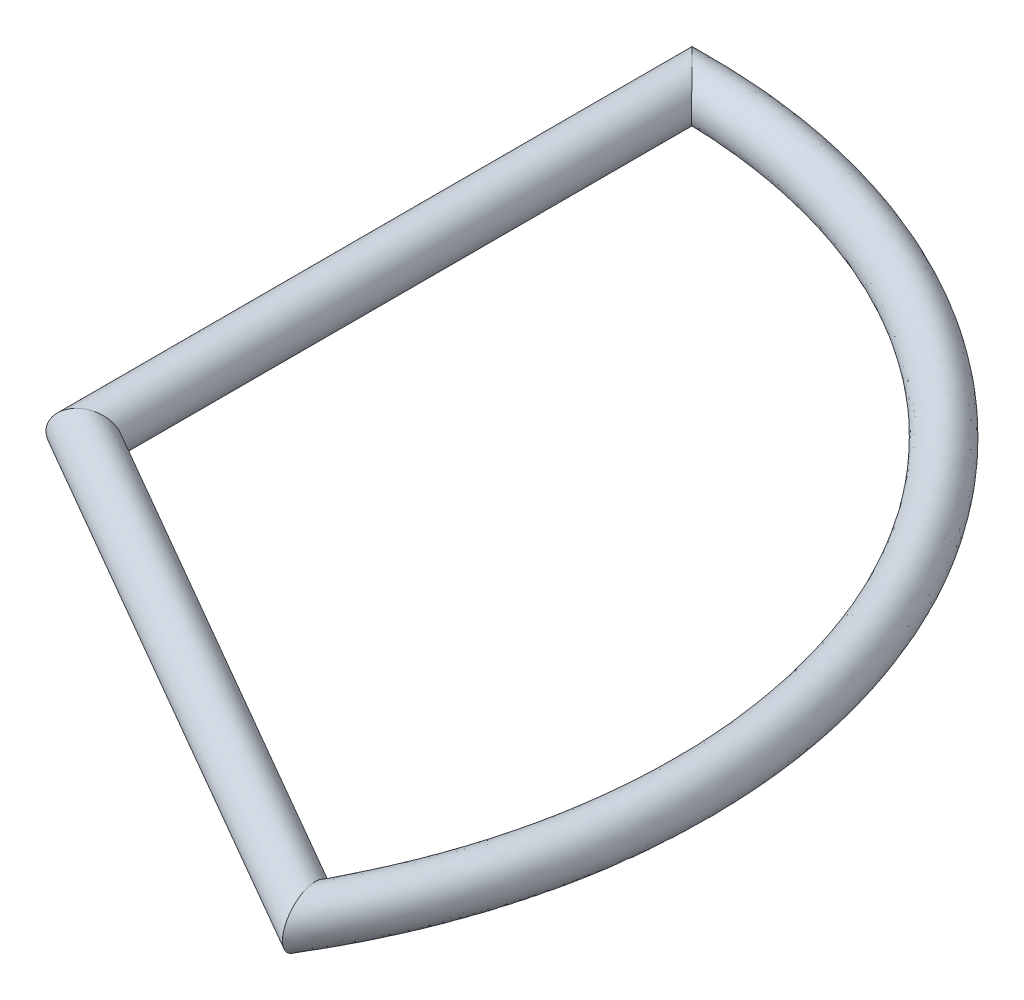
ISO-10303-21;
HEADER;
FILE_DESCRIPTION(('STEP AP214'),'2;1');
FILE_NAME('part.step','',(''),(''),'','','');
FILE_SCHEMA(('AUTOMOTIVE_DESIGN { 1 0 10303 214 1 1 1 1 }'));
ENDSEC;
DATA;
#1=APPLICATION_CONTEXT('core data for automotive mechanical design processes');
#2=APPLICATION_PROTOCOL_DEFINITION('international standard','automotive_design',2000,#1);
#3=PRODUCT_CONTEXT('',#1,'mechanical');
#4=PRODUCT('Part','Part','',(#3));
#5=PRODUCT_RELATED_PRODUCT_CATEGORY('part','',(#4));
#6=PRODUCT_DEFINITION_FORMATION('','',#4);
#7=PRODUCT_DEFINITION_CONTEXT('part definition',#1,'design');
#8=PRODUCT_DEFINITION('design','',#6,#7);
#9=PRODUCT_DEFINITION_SHAPE('','',#8);
#10=(LENGTH_UNIT() NAMED_UNIT(*) SI_UNIT(.MILLI.,.METRE.));
#11=(NAMED_UNIT(*) PLANE_ANGLE_UNIT() SI_UNIT($,.RADIAN.));
#12=(NAMED_UNIT(*) SI_UNIT($,.STERADIAN.) SOLID_ANGLE_UNIT());
#13=UNCERTAINTY_MEASURE_WITH_UNIT(LENGTH_MEASURE(1.E-05),#10,'distance_accuracy_value','');
#14=(GEOMETRIC_REPRESENTATION_CONTEXT(3) GLOBAL_UNCERTAINTY_ASSIGNED_CONTEXT((#13)) GLOBAL_UNIT_ASSIGNED_CONTEXT((#10,
#11,#12)) REPRESENTATION_CONTEXT('',''));
#15=CARTESIAN_POINT('',(0.,0.,0.));
#16=DIRECTION('',(0.,0.,1.));
#17=DIRECTION('',(1.,0.,0.));
#18=AXIS2_PLACEMENT_3D('',#15,#16,#17);
#19=CARTESIAN_POINT('',(28.7927465996211,0.,16.6235000000001));
#20=DIRECTION('',(-0.866025403784436,0.,-0.500000000000004));
#21=DIRECTION('',(-0.500000000000004,0.,0.866025403784436));
#22=AXIS2_PLACEMENT_3D('',#19,#20,#21);
#23=CYLINDRICAL_SURFACE('',#22,1.27);
#24=CARTESIAN_POINT('',(27.4963065701557,1.27,15.875));
#25=CARTESIAN_POINT('',(27.4969214642074,1.26999998985122,15.8772947797057));
#26=CARTESIAN_POINT('',(27.4975363774385,1.26999665709549,15.8795896312304));
#27=CARTESIAN_POINT('',(27.5338248542325,1.26960380813354,16.0150179661764));
#28=CARTESIAN_POINT('',(27.5695534037974,1.25802988155791,16.1483574657615));
#29=CARTESIAN_POINT('',(27.6400852563263,1.21179781113142,16.4115845333933));
#30=CARTESIAN_POINT('',(27.6748865141054,1.1770924302441,16.5414644710377));
#31=CARTESIAN_POINT('',(27.7319882583549,1.09703720224082,16.7545713890624));
#32=CARTESIAN_POINT('',(27.7548886480355,1.05807213294263,16.8400370819576));
#33=CARTESIAN_POINT('',(27.7988700856306,0.967092671233383,17.0041787155149));
#34=CARTESIAN_POINT('',(27.8199551342778,0.915108015454744,17.0828695868332));
#35=CARTESIAN_POINT('',(27.8542594044767,0.812424274799389,17.2108955412529));
#36=CARTESIAN_POINT('',(27.8681043769644,0.764854897462241,17.2625659635498));
#37=CARTESIAN_POINT('',(27.8936947033329,0.66185523842023,17.3580708716471));
#38=CARTESIAN_POINT('',(27.9054423322164,0.606433592655216,17.401913847931));
#39=CARTESIAN_POINT('',(27.9240271140674,0.500120588690125,17.4712735422021));
#40=CARTESIAN_POINT('',(27.9313767966611,0.450571661631831,17.4987030602328));
#41=CARTESIAN_POINT('',(27.9438597728602,0.347484370881552,17.5452903717993));
#42=CARTESIAN_POINT('',(27.9489969335109,0.29395316111034,17.5644625974285));
#43=CARTESIAN_POINT('',(27.9555786248677,0.200168825391895,17.5890259047741));
#44=CARTESIAN_POINT('',(27.9576623214946,0.160575505241367,17.5968023971602));
#45=CARTESIAN_POINT('',(27.9604531863403,0.0806613114978532,17.6072180873077));
#46=CARTESIAN_POINT('',(27.9611601722016,0.0403403422352147,17.6098566044994));
#47=CARTESIAN_POINT('',(27.9611574532638,-0.0566239082998585,17.6098464573199));
#48=CARTESIAN_POINT('',(27.9597607005151,-0.113285986127845,17.6046336853695));
#49=CARTESIAN_POINT('',(27.9542916379542,-0.224662733321905,17.5842227847676));
#50=CARTESIAN_POINT('',(27.9502161264058,-0.279374989599951,17.5690127070236));
#51=CARTESIAN_POINT('',(27.9397449180558,-0.384902732857072,17.5299334563946));
#52=CARTESIAN_POINT('',(27.9333650543853,-0.435742011837644,17.5061233738715));
#53=CARTESIAN_POINT('',(27.9186757084718,-0.533023337754585,17.4513017272005));
#54=CARTESIAN_POINT('',(27.9103655069249,-0.579463736427295,17.4202874785559));
#55=CARTESIAN_POINT('',(27.8884811701319,-0.685558108569258,17.338613599404));
#56=CARTESIAN_POINT('',(27.8741436358349,-0.742857364426685,17.2851049040859));
#57=CARTESIAN_POINT('',(27.8432635179,-0.84790601153226,17.1698581159828));
#58=CARTESIAN_POINT('',(27.8267146712379,-0.895627277700198,17.1080966491562));
#59=CARTESIAN_POINT('',(27.7969612979477,-0.969698228065375,16.9970550081041));
#60=CARTESIAN_POINT('',(27.784122286089,-0.998286527447249,16.9491389458228));
#61=CARTESIAN_POINT('',(27.7578574707548,-1.05084209395177,16.8511169348892));
#62=CARTESIAN_POINT('',(27.7444326813281,-1.07481698624917,16.8010147706359));
#63=CARTESIAN_POINT('',(27.7034166121963,-1.14027743682543,16.6479403392599));
#64=CARTESIAN_POINT('',(27.6751122707574,-1.17523007740622,16.5423070168282));
#65=CARTESIAN_POINT('',(27.6220793673155,-1.2246352781542,16.3443859624406));
#66=CARTESIAN_POINT('',(27.5974896378778,-1.24144936731578,16.2526162682291));
#67=CARTESIAN_POINT('',(27.5479767021379,-1.26398728683644,16.0678329542183));
#68=CARTESIAN_POINT('',(27.5230537833404,-1.26972012645811,15.9748204068908));
#69=CARTESIAN_POINT('',(27.4975363812735,-1.26999666412354,15.8795896455433));
#70=CARTESIAN_POINT('',(27.4969214679992,-1.26999999709977,15.8772947938574));
#71=CARTESIAN_POINT('',(27.4963065701557,-1.27,15.875));
#72=B_SPLINE_CURVE_WITH_KNOTS('',3,(#24,#25,#26,#27,#28,#29,#30,#31,#32,#33,#34,#35,#36,#37,#38,
#39,#40,#41,#42,#43,#44,#45,#46,#47,#48,#49,#50,#51,#52,#53,#54,#55,#56,#57,#58,#59,#60,#61,#62,
#63,#64,#65,#66,#67,#68,#69,#70,#71),.UNSPECIFIED.,.F.,.F.,(4,2,2,2,2,2,2,2,2,2,2,2,2,2,2,2,2,2,
2,2,2,2,2,4),(0.,0.00712741888772688,0.420606172941244,0.83493189488802,1.12406729546069,
1.41254824123145,1.62658892472379,1.84039600726779,2.01106048621675,2.1814254552545,
2.3023034445527,2.42319744410438,2.59289086675069,2.76278748200641,2.93153828292778,
3.10035206681709,3.33814572734207,3.5766277522816,3.74815421597806,3.91939469360271,
4.26226139955855,4.55113345364006,4.8397705504049,4.84689796929262),.UNSPECIFIED.);
#73=CARTESIAN_POINT('',(27.4963065701557,1.27,15.875));
#74=VERTEX_POINT('',#73);
#75=CARTESIAN_POINT('',(27.4963065701557,-1.27,15.875));
#76=VERTEX_POINT('',#75);
#77=EDGE_CURVE('E36',#74,#76,#72,.T.);
#78=ORIENTED_EDGE('',*,*,#77,.F.);
#79=CARTESIAN_POINT('',(27.4963065701557,1.27,15.875));
#80=CARTESIAN_POINT('',(27.4956916765024,1.26999998976507,15.8727052187226));
#81=CARTESIAN_POINT('',(27.4950766722444,1.2699966570136,15.8704103916472));
#82=CARTESIAN_POINT('',(27.4584095971796,1.26959987950454,15.7336127100233));
#83=CARTESIAN_POINT('',(27.4219875447683,1.25779318879046,15.5989882910845));
#84=CARTESIAN_POINT('',(27.3494790714927,1.21092843828973,15.33339198421));
#85=CARTESIAN_POINT('',(27.3133935657792,1.17581926024485,15.2024287875218));
#86=CARTESIAN_POINT('',(27.2535081473661,1.09484568610324,14.9869305889633));
#87=CARTESIAN_POINT('',(27.2292426076091,1.05527297641468,14.9001589835931));
#88=CARTESIAN_POINT('',(27.1823832259628,0.962886612098985,14.7335346740317));
#89=CARTESIAN_POINT('',(27.1597856231871,0.910104002741091,14.6536663300503));
#90=CARTESIAN_POINT('',(27.1231511909035,0.806615694540184,14.524826036936));
#91=CARTESIAN_POINT('',(27.1084583088276,0.759254543035397,14.4733613221204));
#92=CARTESIAN_POINT('',(27.0811878554279,0.656735549503093,14.3781403917081));
#93=CARTESIAN_POINT('',(27.0686078783303,0.601586708192637,14.334375406391));
#94=CARTESIAN_POINT('',(27.0487318956416,0.496231268267525,14.2653953431346));
#95=CARTESIAN_POINT('',(27.0408810333259,0.447421975099813,14.2382147929855));
#96=CARTESIAN_POINT('',(27.0274956213471,0.345830534338047,14.1919369038606));
#97=CARTESIAN_POINT('',(27.0219569839865,0.293055594112111,14.1728252994078));
#98=CARTESIAN_POINT('',(27.0147911117378,0.2000725609079,14.1481166340965));
#99=CARTESIAN_POINT('',(27.0125013759883,0.160516181367087,14.1402285117067));
#100=CARTESIAN_POINT('',(27.009433020129,0.0806463915532493,14.1296602327367));
#101=CARTESIAN_POINT('',(27.0086545693617,0.040332896954889,14.1269806597851));
#102=CARTESIAN_POINT('',(27.0086577363679,-0.0560352036821328,14.1269911914515));
#103=CARTESIAN_POINT('',(27.0101647046629,-0.112107857858795,14.1321779441015));
#104=CARTESIAN_POINT('',(27.0160515945037,-0.222287947171014,14.1524614808419));
#105=CARTESIAN_POINT('',(27.0204350721535,-0.276392862181267,14.1675705314568));
#106=CARTESIAN_POINT('',(27.0316564190515,-0.380678532419805,14.206315372831));
#107=CARTESIAN_POINT('',(27.0384762092818,-0.430884961561547,14.2298883620459));
#108=CARTESIAN_POINT('',(27.0541193648653,-0.526949848361964,14.2840787043163));
#109=CARTESIAN_POINT('',(27.0629435476083,-0.572806521347839,14.3146989312982));
#110=CARTESIAN_POINT('',(27.0863393082963,-0.678734305692221,14.3960945491155));
#111=CARTESIAN_POINT('',(27.1017425417994,-0.736328730869981,14.4498476738357));
#112=CARTESIAN_POINT('',(27.1347461529962,-0.841880517539399,14.5655303857289));
#113=CARTESIAN_POINT('',(27.1523509160205,-0.889818131148607,14.6274763071201));
#114=CARTESIAN_POINT('',(27.1835440310155,-0.963586678798072,14.7377572041976));
#115=CARTESIAN_POINT('',(27.196770960399,-0.991753383895898,14.7846654102202));
#116=CARTESIAN_POINT('',(27.2237265119856,-1.04369814137381,14.8805863773523));
#117=CARTESIAN_POINT('',(27.2374542218328,-1.06748373975265,14.9295953371485));
#118=CARTESIAN_POINT('',(27.2792453174113,-1.13270573756961,15.0793182902504));
#119=CARTESIAN_POINT('',(27.3078873564526,-1.16794052755428,15.1826248801874));
#120=CARTESIAN_POINT('',(27.3628997737089,-1.22016899619412,15.3825042251818));
#121=CARTESIAN_POINT('',(27.3892137633154,-1.23862506875641,15.4787288523652));
#122=CARTESIAN_POINT('',(27.4419020024439,-1.26338859000676,15.672688904192));
#123=CARTESIAN_POINT('',(27.468276181569,-1.26970637063076,15.7704229725179));
#124=CARTESIAN_POINT('',(27.4950766687279,-1.26999666345783,15.8704103793044));
#125=CARTESIAN_POINT('',(27.4956916730235,-1.26999999640724,15.8727052065292));
#126=CARTESIAN_POINT('',(27.4963065701557,-1.27,15.875));
#127=B_SPLINE_CURVE_WITH_KNOTS('',3,(#79,#80,#81,#82,#83,#84,#85,#86,#87,#88,#89,#90,#91,#92,
#93,#94,#95,#96,#97,#98,#99,#100,#101,#102,#103,#104,#105,#106,#107,#108,#109,#110,#111,#112,
#113,#114,#115,#116,#117,#118,#119,#120,#121,#122,#123,#124,#125,#126),.UNSPECIFIED.,.F.,.F.,(4,
2,2,2,2,2,2,2,2,2,2,2,2,2,2,2,2,2,2,2,2,2,2,4),(0.,0.00712741889428657,0.42486832732224,
0.843528668926549,1.13784104620255,1.43146813532141,1.64518018664807,1.85864722908586,
2.02724974554671,2.1955529204936,2.3164074227256,2.43727546616816,2.60519956645137,
2.77333165610962,2.94024116430608,3.10721886067977,3.34671948146859,3.58670500985727,
3.75536277278302,3.92372726693388,4.26083154751238,4.56450681145005,4.86792347674503,
4.87505089563931),.UNSPECIFIED.);
#128=EDGE_CURVE('E67',#74,#76,#127,.T.);
#129=ORIENTED_EDGE('',*,*,#128,.T.);
#130=EDGE_LOOP('',(#78,#129));
#131=FACE_BOUND('',#130,.T.);
#132=CARTESIAN_POINT('',(0.,0.,0.));
#133=DIRECTION('',(-0.499999999999998,0.,-0.86602540378444));
#134=DIRECTION('',(0.86602540378444,0.,-0.499999999999998));
#135=AXIS2_PLACEMENT_3D('',#132,#133,#134);
#136=ELLIPSE('',#135,1.46646968374165,1.27);
#137=CARTESIAN_POINT('',(1.27,0.,-0.733234841870821));
#138=VERTEX_POINT('',#137);
#139=EDGE_CURVE('E52',#138,#138,#136,.T.);
#140=ORIENTED_EDGE('',*,*,#139,.F.);
#141=EDGE_LOOP('',(#140));
#142=FACE_BOUND('',#141,.T.);
#143=ADVANCED_FACE('F33',(#131,#142),#23,.T.);
#144=CARTESIAN_POINT('',(-1.49699999999999,0.,-30.48));
#145=CARTESIAN_POINT('',(-0.998000000000025,0.,-30.48));
#146=CARTESIAN_POINT('',(-0.489019965882409,0.,-30.480003771968));
#147=CARTESIAN_POINT('',(0.679208098510064,0.,-30.4799947610499));
#148=CARTESIAN_POINT('',(1.33050312297397,0.,-30.4582092320787));
#149=CARTESIAN_POINT('',(2.6578383673523,0.,-30.3711811327486));
#150=CARTESIAN_POINT('',(3.32001555636649,0.,-30.3059423968142));
#151=CARTESIAN_POINT('',(5.29799138465832,0.,-30.0454768426544));
#152=CARTESIAN_POINT('',(6.60523374841277,0.,-29.7854001784761));
#153=CARTESIAN_POINT('',(10.4591064770736,0.,-28.7526102876448));
#154=CARTESIAN_POINT('',(12.9364750130309,0.,-27.7263950786619));
#155=CARTESIAN_POINT('',(19.8470499739383,0.,-23.7365727647252));
#156=CARTESIAN_POINT('',(23.7365727255242,0.,-19.8470500418384));
#157=CARTESIAN_POINT('',(29.0563358891753,0.,-10.6329499581614));
#158=CARTESIAN_POINT('',(30.48,0.,-5.31976308522459));
#159=CARTESIAN_POINT('',(30.48,0.,2.65988154261245));
#160=CARTESIAN_POINT('',(30.1300441727532,0.,5.31845323380196));
#161=CARTESIAN_POINT('',(29.0975300906511,0.,9.17239986517265));
#162=CARTESIAN_POINT('',(28.6691419068847,0.,10.4345432931812));
#163=CARTESIAN_POINT('',(27.9057237794523,0.,12.2777533856348));
#164=CARTESIAN_POINT('',(27.6311335875778,0.,12.8838350210951));
#165=CARTESIAN_POINT('',(27.042834510246,0.,14.0768551117287));
#166=CARTESIAN_POINT('',(26.7360538195432,0.,14.6517859127587));
#167=CARTESIAN_POINT('',(26.1519475910267,0.,15.6635055993965));
#168=CARTESIAN_POINT('',(25.8974543073498,0.,16.1042933529719));
#169=CARTESIAN_POINT('',(25.6479543073496,0.,16.5364400294654));
#170=CARTESIAN_POINT('',(-1.49699999999999,2.54,-30.48));
#171=CARTESIAN_POINT('',(-0.998000000000025,2.54,-30.48));
#172=CARTESIAN_POINT('',(-0.489019965882409,2.54,-30.480003771968));
#173=CARTESIAN_POINT('',(0.679208098510064,2.54,-30.4799947610499));
#174=CARTESIAN_POINT('',(1.33050312297397,2.54,-30.4582092320787));
#175=CARTESIAN_POINT('',(2.6578383673523,2.54,-30.3711811327486));
#176=CARTESIAN_POINT('',(3.32001555636649,2.54,-30.3059423968142));
#177=CARTESIAN_POINT('',(5.29799138465832,2.54,-30.0454768426544));
#178=CARTESIAN_POINT('',(6.60523374841277,2.54,-29.7854001784761));
#179=CARTESIAN_POINT('',(10.4591064770736,2.54,-28.7526102876448));
#180=CARTESIAN_POINT('',(12.9364750130309,2.54,-27.7263950786619));
#181=CARTESIAN_POINT('',(19.8470499739383,2.54,-23.7365727647252));
#182=CARTESIAN_POINT('',(23.7365727255242,2.54,-19.8470500418384));
#183=CARTESIAN_POINT('',(29.0563358891753,2.54,-10.6329499581614));
#184=CARTESIAN_POINT('',(30.48,2.54,-5.31976308522459));
#185=CARTESIAN_POINT('',(30.48,2.54,2.65988154261245));
#186=CARTESIAN_POINT('',(30.1300441727532,2.54,5.31845323380196));
#187=CARTESIAN_POINT('',(29.0975300906511,2.54,9.17239986517265));
#188=CARTESIAN_POINT('',(28.6691419068847,2.54,10.4345432931812));
#189=CARTESIAN_POINT('',(27.9057237794523,2.54,12.2777533856348));
#190=CARTESIAN_POINT('',(27.6311335875778,2.54,12.8838350210951));
#191=CARTESIAN_POINT('',(27.042834510246,2.54,14.0768551117287));
#192=CARTESIAN_POINT('',(26.7360538195432,2.54,14.6517859127587));
#193=CARTESIAN_POINT('',(26.1519475910267,2.54,15.6635055993965));
#194=CARTESIAN_POINT('',(25.8974543073498,2.54,16.1042933529719));
#195=CARTESIAN_POINT('',(25.6479543073496,2.54,16.5364400294654));
#196=CARTESIAN_POINT('',(-1.49699999999999,2.54,-33.02));
#197=CARTESIAN_POINT('',(-0.998000000000025,2.54,-33.02));
#198=CARTESIAN_POINT('',(-0.508979963039276,2.54,-33.0200040862979));
#199=CARTESIAN_POINT('',(0.706930876026354,2.54,-33.0199943244717));
#200=CARTESIAN_POINT('',(1.44137838322177,2.54,-32.996393334752));
#201=CARTESIAN_POINT('',(2.87932489796503,2.54,-32.9021128938109));
#202=CARTESIAN_POINT('',(3.59668351939658,2.54,-32.8314375965484));
#203=CARTESIAN_POINT('',(5.73949066671408,2.54,-32.5492665795431));
#204=CARTESIAN_POINT('',(7.15566989411584,2.54,-32.2675168600164));
#205=CARTESIAN_POINT('',(11.3306986834924,2.54,-31.1486611449474));
#206=CARTESIAN_POINT('',(14.0145145974503,2.54,-30.0369280018837));
#207=CARTESIAN_POINT('',(21.5009708050994,2.54,-25.714620495119));
#208=CARTESIAN_POINT('',(25.7146204526496,2.54,-21.5009708786615));
#209=CARTESIAN_POINT('',(31.4776972132748,2.54,-11.5190291213383));
#210=CARTESIAN_POINT('',(33.02,2.54,-5.76307667565997));
#211=CARTESIAN_POINT('',(33.02,2.54,2.88153833783016));
#212=CARTESIAN_POINT('',(32.6408811871389,2.54,5.76165766994932));
#213=CARTESIAN_POINT('',(31.5223242648772,2.54,9.93676652060511));
#214=CARTESIAN_POINT('',(31.0582370657908,2.54,11.3040885676125));
#215=CARTESIAN_POINT('',(30.2312007610738,2.54,13.3008995011046));
#216=CARTESIAN_POINT('',(29.9337280532083,2.54,13.9574879395197));
#217=CARTESIAN_POINT('',(29.2964040527675,2.54,15.2499263710394));
#218=CARTESIAN_POINT('',(28.9496193558245,2.54,15.8977770648774));
#219=CARTESIAN_POINT('',(28.3416723902796,2.54,16.9507916211585));
#220=CARTESIAN_POINT('',(28.0971588329623,2.54,17.3742933529719));
#221=CARTESIAN_POINT('',(27.8476588329621,2.54,17.8064400294654));
#222=CARTESIAN_POINT('',(-1.49699999999999,0.,-33.02));
#223=CARTESIAN_POINT('',(-0.998000000000025,0.,-33.02));
#224=CARTESIAN_POINT('',(-0.508979963039276,0.,-33.0200040862979));
#225=CARTESIAN_POINT('',(0.706930876026354,0.,-33.0199943244717));
#226=CARTESIAN_POINT('',(1.44137838322177,0.,-32.996393334752));
#227=CARTESIAN_POINT('',(2.87932489796503,0.,-32.9021128938109));
#228=CARTESIAN_POINT('',(3.59668351939658,0.,-32.8314375965484));
#229=CARTESIAN_POINT('',(5.73949066671408,0.,-32.5492665795431));
#230=CARTESIAN_POINT('',(7.15566989411584,0.,-32.2675168600164));
#231=CARTESIAN_POINT('',(11.3306986834924,0.,-31.1486611449474));
#232=CARTESIAN_POINT('',(14.0145145974503,0.,-30.0369280018837));
#233=CARTESIAN_POINT('',(21.5009708050994,0.,-25.714620495119));
#234=CARTESIAN_POINT('',(25.7146204526496,0.,-21.5009708786567));
#235=CARTESIAN_POINT('',(31.4776972132748,0.,-11.5190291213432));
#236=CARTESIAN_POINT('',(33.02,0.,-5.76307667565997));
#237=CARTESIAN_POINT('',(33.02,0.,2.88153833783016));
#238=CARTESIAN_POINT('',(32.6408811871437,0.,5.76165766994932));
#239=CARTESIAN_POINT('',(31.5223242648748,0.,9.93676652060511));
#240=CARTESIAN_POINT('',(31.0582370657908,0.,11.3040885676125));
#241=CARTESIAN_POINT('',(30.2312007610738,0.,13.3008995011046));
#242=CARTESIAN_POINT('',(29.9337280532083,0.,13.9574879395197));
#243=CARTESIAN_POINT('',(29.2964040527675,0.,15.2499263710394));
#244=CARTESIAN_POINT('',(28.9496193558245,0.,15.8977770648774));
#245=CARTESIAN_POINT('',(28.3416723902796,0.,16.9507916211585));
#246=CARTESIAN_POINT('',(28.0971588329623,0.,17.3742933529719));
#247=CARTESIAN_POINT('',(27.8476588329621,0.,17.8064400294654));
#248=CARTESIAN_POINT('',(-1.49699999999999,-2.54,-33.02));
#249=CARTESIAN_POINT('',(-0.998000000000025,-2.54,-33.02));
#250=CARTESIAN_POINT('',(-0.508979963039276,-2.54,-33.0200040862979));
#251=CARTESIAN_POINT('',(0.706930876026354,-2.54,-33.0199943244717));
#252=CARTESIAN_POINT('',(1.44137838322177,-2.54,-32.996393334752));
#253=CARTESIAN_POINT('',(2.87932489796503,-2.54,-32.9021128938109));
#254=CARTESIAN_POINT('',(3.59668351939658,-2.54,-32.8314375965484));
#255=CARTESIAN_POINT('',(5.73949066671408,-2.54,-32.5492665795431));
#256=CARTESIAN_POINT('',(7.15566989411584,-2.54,-32.2675168600164));
#257=CARTESIAN_POINT('',(11.3306986834924,-2.54,-31.1486611449474));
#258=CARTESIAN_POINT('',(14.0145145974503,-2.54,-30.0369280018837));
#259=CARTESIAN_POINT('',(21.5009708050994,-2.54,-25.714620495119));
#260=CARTESIAN_POINT('',(25.7146204526496,-2.54,-21.5009708786519));
#261=CARTESIAN_POINT('',(31.4776972132748,-2.54,-11.519029121348));
#262=CARTESIAN_POINT('',(33.02,-2.54,-5.76307667565997));
#263=CARTESIAN_POINT('',(33.02,-2.54,2.88153833783016));
#264=CARTESIAN_POINT('',(32.6408811871485,-2.54,5.76165766994932));
#265=CARTESIAN_POINT('',(31.5223242648724,-2.54,9.93676652060511));
#266=CARTESIAN_POINT('',(31.0582370657908,-2.54,11.3040885676125));
#267=CARTESIAN_POINT('',(30.2312007610738,-2.54,13.3008995011046));
#268=CARTESIAN_POINT('',(29.9337280532083,-2.54,13.9574879395197));
#269=CARTESIAN_POINT('',(29.2964040527675,-2.54,15.2499263710394));
#270=CARTESIAN_POINT('',(28.9496193558245,-2.54,15.8977770648774));
#271=CARTESIAN_POINT('',(28.3416723902796,-2.54,16.9507916211585));
#272=CARTESIAN_POINT('',(28.0971588329623,-2.54,17.3742933529719));
#273=CARTESIAN_POINT('',(27.8476588329621,-2.54,17.8064400294654));
#274=CARTESIAN_POINT('',(-1.49699999999999,-2.54,-30.48));
#275=CARTESIAN_POINT('',(-0.998000000000025,-2.54,-30.48));
#276=CARTESIAN_POINT('',(-0.489019965882409,-2.54,-30.480003771968));
#277=CARTESIAN_POINT('',(0.679208098510064,-2.54,-30.4799947610499));
#278=CARTESIAN_POINT('',(1.33050312297397,-2.54,-30.4582092320787));
#279=CARTESIAN_POINT('',(2.6578383673523,-2.54,-30.3711811327486));
#280=CARTESIAN_POINT('',(3.32001555636649,-2.54,-30.3059423968142));
#281=CARTESIAN_POINT('',(5.29799138465832,-2.54,-30.0454768426544));
#282=CARTESIAN_POINT('',(6.60523374841277,-2.54,-29.7854001784761));
#283=CARTESIAN_POINT('',(10.4591064770736,-2.54,-28.7526102876448));
#284=CARTESIAN_POINT('',(12.9364750130309,-2.54,-27.7263950786619));
#285=CARTESIAN_POINT('',(19.8470499739383,-2.54,-23.7365727647252));
#286=CARTESIAN_POINT('',(23.7365727255242,-2.54,-19.8470500418384));
#287=CARTESIAN_POINT('',(29.0563358891753,-2.54,-10.6329499581614));
#288=CARTESIAN_POINT('',(30.48,-2.54,-5.31976308522459));
#289=CARTESIAN_POINT('',(30.48,-2.54,2.65988154261245));
#290=CARTESIAN_POINT('',(30.1300441727532,-2.54,5.31845323380196));
#291=CARTESIAN_POINT('',(29.0975300906511,-2.54,9.17239986517265));
#292=CARTESIAN_POINT('',(28.6691419068847,-2.54,10.4345432931812));
#293=CARTESIAN_POINT('',(27.9057237794523,-2.54,12.2777533856348));
#294=CARTESIAN_POINT('',(27.6311335875778,-2.54,12.8838350210951));
#295=CARTESIAN_POINT('',(27.042834510246,-2.54,14.0768551117287));
#296=CARTESIAN_POINT('',(26.7360538195432,-2.54,14.6517859127587));
#297=CARTESIAN_POINT('',(26.1519475910267,-2.54,15.6635055993965));
#298=CARTESIAN_POINT('',(25.8974543073498,-2.54,16.1042933529719));
#299=CARTESIAN_POINT('',(25.6479543073496,-2.54,16.5364400294654));
#300=CARTESIAN_POINT('',(-1.49699999999999,0.,-30.48));
#301=CARTESIAN_POINT('',(-0.998000000000025,0.,-30.48));
#302=CARTESIAN_POINT('',(-0.489019965882409,0.,-30.480003771968));
#303=CARTESIAN_POINT('',(0.679208098510064,0.,-30.4799947610499));
#304=CARTESIAN_POINT('',(1.33050312297397,0.,-30.4582092320787));
#305=CARTESIAN_POINT('',(2.6578383673523,0.,-30.3711811327486));
#306=CARTESIAN_POINT('',(3.32001555636649,0.,-30.3059423968142));
#307=CARTESIAN_POINT('',(5.29799138465832,0.,-30.0454768426544));
#308=CARTESIAN_POINT('',(6.60523374841277,0.,-29.7854001784761));
#309=CARTESIAN_POINT('',(10.4591064770736,0.,-28.7526102876448));
#310=CARTESIAN_POINT('',(12.9364750130309,0.,-27.7263950786619));
#311=CARTESIAN_POINT('',(19.8470499739383,0.,-23.7365727647252));
#312=CARTESIAN_POINT('',(23.7365727255242,0.,-19.8470500418384));
#313=CARTESIAN_POINT('',(29.0563358891753,0.,-10.6329499581614));
#314=CARTESIAN_POINT('',(30.48,0.,-5.31976308522459));
#315=CARTESIAN_POINT('',(30.48,0.,2.65988154261245));
#316=CARTESIAN_POINT('',(30.1300441727532,0.,5.31845323380196));
#317=CARTESIAN_POINT('',(29.0975300906511,0.,9.17239986517265));
#318=CARTESIAN_POINT('',(28.6691419068847,0.,10.4345432931812));
#319=CARTESIAN_POINT('',(27.9057237794523,0.,12.2777533856348));
#320=CARTESIAN_POINT('',(27.6311335875778,0.,12.8838350210951));
#321=CARTESIAN_POINT('',(27.042834510246,0.,14.0768551117287));
#322=CARTESIAN_POINT('',(26.7360538195432,0.,14.6517859127587));
#323=CARTESIAN_POINT('',(26.1519475910267,0.,15.6635055993965));
#324=CARTESIAN_POINT('',(25.8974543073498,0.,16.1042933529719));
#325=CARTESIAN_POINT('',(25.6479543073496,0.,16.5364400294654));
#326=(BOUNDED_SURFACE() B_SPLINE_SURFACE(3,3,((#144,#145,#146,#147,#148,#149,#150,#151,#152,
#153,#154,#155,#156,#157,#158,#159,#160,#161,#162,#163,#164,#165,#166,#167,#168,#169),(#170,
#171,#172,#173,#174,#175,#176,#177,#178,#179,#180,#181,#182,#183,#184,#185,#186,#187,#188,#189,
#190,#191,#192,#193,#194,#195),(#196,#197,#198,#199,#200,#201,#202,#203,#204,#205,#206,#207,
#208,#209,#210,#211,#212,#213,#214,#215,#216,#217,#218,#219,#220,#221),(#222,#223,#224,#225,
#226,#227,#228,#229,#230,#231,#232,#233,#234,#235,#236,#237,#238,#239,#240,#241,#242,#243,#244,
#245,#246,#247),(#248,#249,#250,#251,#252,#253,#254,#255,#256,#257,#258,#259,#260,#261,#262,
#263,#264,#265,#266,#267,#268,#269,#270,#271,#272,#273),(#274,#275,#276,#277,#278,#279,#280,
#281,#282,#283,#284,#285,#286,#287,#288,#289,#290,#291,#292,#293,#294,#295,#296,#297,#298,#299),
(#300,#301,#302,#303,#304,#305,#306,#307,#308,#309,#310,#311,#312,#313,#314,#315,#316,#317,#318,
#319,#320,#321,#322,#323,#324,#325)),.UNSPECIFIED.,.T.,.F.,.F.) B_SPLINE_SURFACE_WITH_KNOTS((4,
3,4),(4,2,2,2,2,2,2,2,2,2,2,2,4),(0.,0.5,1.),(-0.0224995461145828,0.,0.03125,0.0625,0.125,0.25,
0.5,0.75,0.875,0.9375,0.96875,1.,1.02249954611458),
.UNSPECIFIED.) GEOMETRIC_REPRESENTATION_ITEM() RATIONAL_B_SPLINE_SURFACE(((1.,1.,1.,1.,1.,1.,1.,
1.,1.,1.,1.,1.,1.,1.,1.,1.,1.,1.,1.,1.,1.,1.,1.,1.,1.,1.),(0.333333333333333,0.333333333333333,
0.333333333333333,0.333333333333333,0.333333333333333,0.333333333333333,0.333333333333333,
0.333333333333333,0.333333333333333,0.333333333333333,0.333333333333333,0.333333333333333,
0.333333333333333,0.333333333333333,0.333333333333333,0.333333333333333,0.333333333333333,
0.333333333333333,0.333333333333333,0.333333333333333,0.333333333333333,0.333333333333333,
0.333333333333333,0.333333333333333,0.333333333333333,0.333333333333333),(0.333333333333333,
0.333333333333333,0.333333333333333,0.333333333333333,0.333333333333333,0.333333333333333,
0.333333333333333,0.333333333333333,0.333333333333333,0.333333333333333,0.333333333333333,
0.333333333333333,0.333333333333333,0.333333333333333,0.333333333333333,0.333333333333333,
0.333333333333333,0.333333333333333,0.333333333333333,0.333333333333333,0.333333333333333,
0.333333333333333,0.333333333333333,0.333333333333333,0.333333333333333,0.333333333333333),(1.,
1.,1.,1.,1.,1.,1.,1.,1.,1.,1.,1.,1.,1.,1.,1.,1.,1.,1.,1.,1.,1.,1.,1.,1.,1.),(0.333333333333333,
0.333333333333333,0.333333333333333,0.333333333333333,0.333333333333333,0.333333333333333,
0.333333333333333,0.333333333333333,0.333333333333333,0.333333333333333,0.333333333333333,
0.333333333333333,0.333333333333333,0.333333333333333,0.333333333333333,0.333333333333333,
0.333333333333333,0.333333333333333,0.333333333333333,0.333333333333333,0.333333333333333,
0.333333333333333,0.333333333333333,0.333333333333333,0.333333333333333,0.333333333333333),
(0.333333333333333,0.333333333333333,0.333333333333333,0.333333333333333,0.333333333333333,
0.333333333333333,0.333333333333333,0.333333333333333,0.333333333333333,0.333333333333333,
0.333333333333333,0.333333333333333,0.333333333333333,0.333333333333333,0.333333333333333,
0.333333333333333,0.333333333333333,0.333333333333333,0.333333333333333,0.333333333333333,
0.333333333333333,0.333333333333333,0.333333333333333,0.333333333333333,0.333333333333333,
0.333333333333333),(1.,1.,1.,1.,1.,1.,1.,1.,1.,1.,1.,1.,1.,1.,1.,1.,1.,1.,1.,1.,1.,1.,1.,1.,1.,1.))) REPRESENTATION_ITEM('') SURFACE());
#327=CARTESIAN_POINT('',(0.,1.27,-31.75));
#328=CARTESIAN_POINT('',(-0.00167989049537566,1.26999998985122,-31.7516799037222));
#329=CARTESIAN_POINT('',(-0.00335983359816553,1.26999665709549,-31.7533598599638));
#330=CARTESIAN_POINT('',(-0.102499973658748,1.26960380813327,-31.8525007702032));
#331=CARTESIAN_POINT('',(-0.200111092843546,1.25802988155781,-31.9501123515611));
#332=CARTESIAN_POINT('',(-0.392806494110948,1.21179781113137,-32.1428082614446));
#333=CARTESIAN_POINT('',(-0.487885190663845,1.17709243024394,-32.2378870035869));
#334=CARTESIAN_POINT('',(-0.643890323270846,1.09703720224058,-32.3938920237197));
#335=CARTESIAN_POINT('',(-0.706455589629597,1.05807213294246,-32.4564571893872));
#336=CARTESIAN_POINT('',(-0.82661569531109,0.967092671233367,-32.5766170484181));
#337=CARTESIAN_POINT('',(-0.884221464595018,0.915108015454813,-32.6342226718457));
#338=CARTESIAN_POINT('',(-0.97794305836663,0.812424274799586,-32.727944018506));
#339=CARTESIAN_POINT('',(-1.01576847045615,0.764854897462464,-32.7657693275434));
#340=CARTESIAN_POINT('',(-1.08568298387029,0.661855238420504,-32.8356836543183));
#341=CARTESIAN_POINT('',(-1.11777830066793,0.606433592655514,-32.8677788875075));
#342=CARTESIAN_POINT('',(-1.16855316697995,0.500120588690424,-32.9185536278498));
#343=CARTESIAN_POINT('',(-1.1886329851113,0.450571661632102,-32.9386333987011));
#344=CARTESIAN_POINT('',(-1.22273729232238,0.347484370881777,-32.9727376289875));
#345=CARTESIAN_POINT('',(-1.2367723464391,0.293953161110548,-32.9867726534289));
#346=CARTESIAN_POINT('',(-1.25475394892294,0.200168825392048,-33.0047542190165));
#347=CARTESIAN_POINT('',(-1.26044674056821,0.160575505241487,-33.0104469994223));
#348=CARTESIAN_POINT('',(-1.26807156041101,0.080661311497911,-33.0180718043509));
#349=CARTESIAN_POINT('',(-1.27000309039669,0.0403403422352442,-33.0200033306628));
#350=CARTESIAN_POINT('',(-1.26999566215037,-0.0566239082998768,-33.0199959024038));
#351=CARTESIAN_POINT('',(-1.26617964559156,-0.113285986127884,-33.0161798930654));
#352=CARTESIAN_POINT('',(-1.25123781843661,-0.224662733321979,-33.0012380956519));
#353=CARTESIAN_POINT('',(-1.240103260491,-0.27937498960004,-32.9901035602456));
#354=CARTESIAN_POINT('',(-1.21149524086036,-0.38490273285721,-32.9614956024917));
#355=CARTESIAN_POINT('',(-1.19406503636439,-0.435742011837816,-32.9440654372188));
#356=CARTESIAN_POINT('',(-1.15393277062674,-0.533023337754805,-32.9039332671574));
#357=CARTESIAN_POINT('',(-1.13122874419468,-0.579463736427528,-32.8812292971849));
#358=CARTESIAN_POINT('',(-1.07143925841999,-0.685558108569439,-32.8214399660012));
#359=CARTESIAN_POINT('',(-1.03226813609967,-0.742857364426813,-32.7822689494134));
#360=CARTESIAN_POINT('',(-0.947901548865327,-0.847906011532285,-32.6979025887584));
#361=CARTESIAN_POINT('',(-0.902688972949601,-0.895627277700171,-32.6526901337325));
#362=CARTESIAN_POINT('',(-0.821400777565753,-0.969698228065296,-32.5714021360889));
#363=CARTESIAN_POINT('',(-0.786323756310195,-0.998286527447163,-32.5363251945191));
#364=CARTESIAN_POINT('',(-0.714566612378807,-1.05084209395167,-32.4645681917472));
#365=CARTESIAN_POINT('',(-0.677889260064201,-1.07481698624907,-32.4278909009365));
#366=CARTESIAN_POINT('',(-0.565830948388772,-1.1402774368253,-32.315832727417));
#367=CARTESIAN_POINT('',(-0.488501978396372,-1.17523007740608,-32.2385037874775));
#368=CARTESIAN_POINT('',(-0.343613769073592,-1.22463527815408,-32.0936154186666));
#369=CARTESIAN_POINT('',(-0.276433747307323,-1.24144936731567,-32.0264352411958));
#370=CARTESIAN_POINT('',(-0.141163171049344,-1.26398728683648,-31.8911641240224));
#371=CARTESIAN_POINT('',(-0.0730734015929871,-1.26972012645829,-31.8230739695421));
#372=CARTESIAN_POINT('',(-0.00335984407602887,-1.26999666412355,-31.7533598704415));
#373=CARTESIAN_POINT('',(-0.00167990085516458,-1.26999999709978,-31.7516799140818));
#374=CARTESIAN_POINT('',(0.,-1.27,-31.75));
#375=B_SPLINE_CURVE_WITH_KNOTS('',3,(#327,#328,#329,#330,#331,#332,#333,#334,#335,#336,#337,
#338,#339,#340,#341,#342,#343,#344,#345,#346,#347,#348,#349,#350,#351,#352,#353,#354,#355,#356,
#357,#358,#359,#360,#361,#362,#363,#364,#365,#366,#367,#368,#369,#370,#371,#372,#373,#374),
.UNSPECIFIED.,.F.,.F.,(4,2,2,2,2,2,2,2,2,2,2,2,2,2,2,2,2,2,2,2,2,2,2,4),(0.,0.00712741888772523,
0.42060617294196,0.83493189488936,1.12406729546156,1.41254824123187,1.62658892472413,
1.84039600726804,2.01106048621707,2.1814254552549,2.30230344455319,2.42319744410495,
2.59289086675131,2.76278748200709,2.93153828292852,3.10035206681789,3.33814572734262,
3.5766277522819,3.74815421597834,3.91939469360296,4.26226139955878,4.55113345364076,
4.83977055040603,4.84689796929376),.UNSPECIFIED.);
#376=CARTESIAN_POINT('',(0.,1.27,-31.75));
#377=VERTEX_POINT('',#376);
#378=CARTESIAN_POINT('',(0.,-1.27,-31.75));
#379=VERTEX_POINT('',#378);
#380=EDGE_CURVE('E46',#377,#379,#375,.T.);
#381=CARTESIAN_POINT('',(0.,1.27,-31.75));
#382=CARTESIAN_POINT('',(0.00167989205567091,1.26999998976458,-31.7483200958369));
#383=CARTESIAN_POINT('',(0.00335976847129872,1.26999665701263,-31.7466400729882));
#384=CARTESIAN_POINT('',(0.103496498403593,1.26959987947615,-31.6464866136853));
#385=CARTESIAN_POINT('',(0.201873638970776,1.2577931887827,-31.5476319815694));
#386=CARTESIAN_POINT('',(0.395632551238386,1.21092843829653,-31.3520396482865));
#387=CARTESIAN_POINT('',(0.49100725367321,1.175819260246,-31.2553070852868));
#388=CARTESIAN_POINT('',(0.647691458886596,1.09484568610217,-31.0956956923469));
#389=CARTESIAN_POINT('',(0.710705103585463,1.05527297641479,-31.0312953157963));
#390=CARTESIAN_POINT('',(0.831576297730475,0.96288661209998,-30.9074017461045));
#391=CARTESIAN_POINT('',(0.889445511188979,0.910104002741611,-30.8478974760451));
#392=CARTESIAN_POINT('',(0.982707261915636,0.806615694540134,-30.7517509804769));
#393=CARTESIAN_POINT('',(1.01993057130665,0.759254543035229,-30.7132942139365));
#394=CARTESIAN_POINT('',(1.08875908931589,0.656735549502844,-30.6420668433136));
#395=CARTESIAN_POINT('',(1.12037068984794,0.60158670819246,-30.6092897709096));
#396=CARTESIAN_POINT('',(1.17017118563819,0.496231268267427,-30.557586633348));
#397=CARTESIAN_POINT('',(1.18978480139823,0.44742197509971,-30.5371973120664));
#398=CARTESIAN_POINT('',(1.2231699230246,0.345830534337893,-30.5024662606903));
#399=CARTESIAN_POINT('',(1.23695173930752,0.293055594111906,-30.4881138578072));
#400=CARTESIAN_POINT('',(1.25476713503632,0.200072560907673,-30.4695536977439));
#401=CARTESIAN_POINT('',(1.26045358153932,0.160516181366895,-30.4636266672221));
#402=CARTESIAN_POINT('',(1.2680718016719,0.0806463915531447,-30.4556852536151));
#403=CARTESIAN_POINT('',(1.27000315453566,0.040332896954837,-30.4536713089992));
#404=CARTESIAN_POINT('',(1.26999561734809,-0.0560352036821676,-30.4536793175403));
#405=CARTESIAN_POINT('',(1.26625724193756,-0.112107857858865,-30.4575777666914));
#406=CARTESIAN_POINT('',(1.25163462876214,-0.222287947171135,-30.4728177312131));
#407=CARTESIAN_POINT('',(1.24074154592743,-0.276392862181403,-30.4841684595221));
#408=CARTESIAN_POINT('',(1.21279820248082,-0.380678532419943,-30.5132588516875));
#409=CARTESIAN_POINT('',(1.19579329009275,-0.430884961561673,-30.5309514578829));
#410=CARTESIAN_POINT('',(1.1566846548385,-0.526949848362147,-30.5715939991486));
#411=CARTESIAN_POINT('',(1.13457885177397,-0.572806521348084,-30.5945460790628));
#412=CARTESIAN_POINT('',(1.07578605933135,-0.678734305692526,-30.655505211068));
#413=CARTESIAN_POINT('',(1.03693610454243,-0.73632873087029,-30.6957213649422));
#414=CARTESIAN_POINT('',(0.953253742862554,-0.841880517539707,-30.7821446866018));
#415=CARTESIAN_POINT('',(0.90840938278909,-0.88981813114891,-30.8283638193041));
#416=CARTESIAN_POINT('',(0.82849988186549,-0.963586678798228,-30.9105182978513));
#417=CARTESIAN_POINT('',(0.794489648495899,-0.991753383895926,-30.9454272577226));
#418=CARTESIAN_POINT('',(0.724897429997687,-1.0436981413734,-31.016731933735));
#419=CARTESIAN_POINT('',(0.689318280725139,-1.06748373975195,-31.0531249590963));
#420=CARTESIAN_POINT('',(0.580549947598343,-1.13270573756957,-31.16417858607));
#421=CARTESIAN_POINT('',(0.505404835854656,-1.16794052755585,-31.2406366144647));
#422=CARTESIAN_POINT('',(0.359810454025235,-1.22016899619278,-31.3882184378308));
#423=CARTESIAN_POINT('',(0.289634477217838,-1.23862506875114,-31.4591193348976));
#424=CARTESIAN_POINT('',(0.148004264579424,-1.26338859001245,-31.6017287143758));
#425=CARTESIAN_POINT('',(0.0765511681554045,-1.26970637065152,-31.6734364576627));
#426=CARTESIAN_POINT('',(0.00335977740211906,-1.26999666345879,-31.7466400637715));
#427=CARTESIAN_POINT('',(0.00167990087602353,-1.26999999640773,-31.7483200867273));
#428=CARTESIAN_POINT('',(0.,-1.27,-31.75));
#429=B_SPLINE_CURVE_WITH_KNOTS('',3,(#381,#382,#383,#384,#385,#386,#387,#388,#389,#390,#391,
#392,#393,#394,#395,#396,#397,#398,#399,#400,#401,#402,#403,#404,#405,#406,#407,#408,#409,#410,
#411,#412,#413,#414,#415,#416,#417,#418,#419,#420,#421,#422,#423,#424,#425,#426,#427,#428),
.UNSPECIFIED.,.F.,.F.,(4,2,2,2,2,2,2,2,2,2,2,2,2,2,2,2,2,2,2,2,2,2,2,4),(0.,0.00712741889428845,
0.424868327326791,0.843528668927093,1.13784104620077,1.43146813532106,1.64518018664827,
1.85864722908567,2.02724974554648,2.19555292049353,2.3164074227254,2.43727546616781,
2.60519956645113,2.77333165610943,2.94024116430584,3.10721886067972,3.34671948146854,
3.58670500985723,3.75536277278196,3.92372726693126,4.2608315475116,4.5645068114516,
4.86792347674452,4.8750508956388),.UNSPECIFIED.);
#430=EDGE_CURVE('E11',#377,#379,#429,.T.);
#431=ORIENTED_EDGE('',*,*,#77,.T.);
#432=ORIENTED_EDGE('',*,*,#128,.F.);
#433=EDGE_LOOP('',(#431,#432));
#434=FACE_BOUND('',#433,.T.);
#435=ORIENTED_EDGE('',*,*,#380,.F.);
#436=ORIENTED_EDGE('',*,*,#430,.T.);
#437=EDGE_LOOP('',(#435,#436));
#438=FACE_BOUND('',#437,.T.);
#439=ADVANCED_FACE('F69',(#434,#438),#326,.F.);
#440=CARTESIAN_POINT('',(0.,0.,0.906558326057903));
#441=DIRECTION('',(0.,0.,-1.));
#442=DIRECTION('',(-1.,0.,0.));
#443=AXIS2_PLACEMENT_3D('',#440,#441,#442);
#444=CYLINDRICAL_SURFACE('',#443,1.27);
#445=ORIENTED_EDGE('',*,*,#139,.T.);
#446=EDGE_LOOP('',(#445));
#447=FACE_BOUND('',#446,.T.);
#448=ORIENTED_EDGE('',*,*,#380,.T.);
#449=ORIENTED_EDGE('',*,*,#430,.F.);
#450=EDGE_LOOP('',(#448,#449));
#451=FACE_BOUND('',#450,.T.);
#452=ADVANCED_FACE('F92',(#447,#451),#444,.T.);
#453=CLOSED_SHELL('',(#143,#439,#452));
#454=MANIFOLD_SOLID_BREP('B2',#453);
#455=ADVANCED_BREP_SHAPE_REPRESENTATION('',(#18,#454),#14);
#456=SHAPE_DEFINITION_REPRESENTATION(#9,#455);
ENDSEC;
END-ISO-10303-21;
